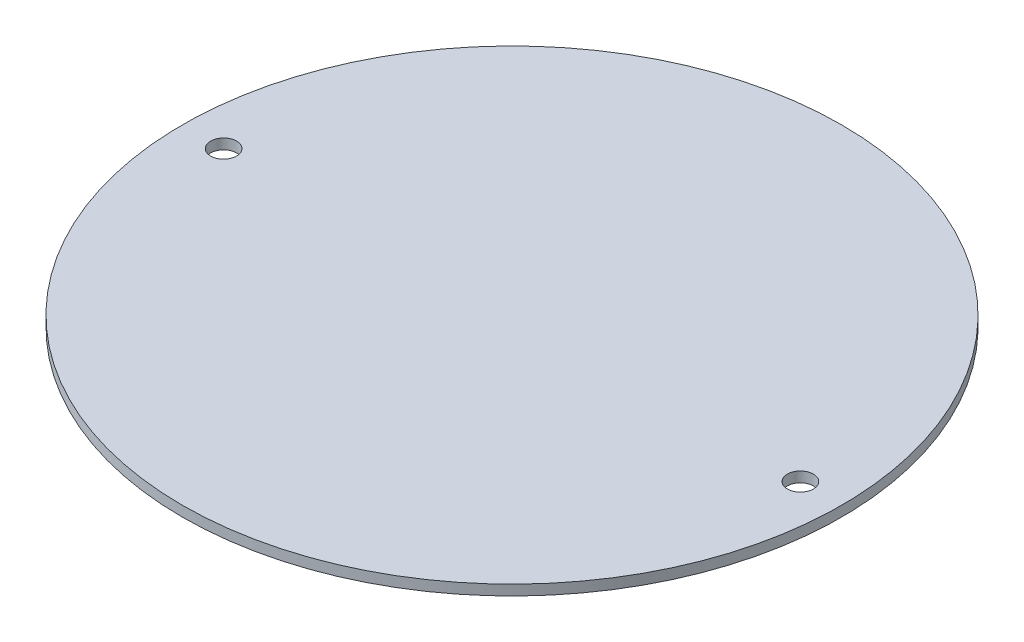
ISO-10303-21;
HEADER;
FILE_DESCRIPTION(('STEP AP214'),'2;1');
FILE_NAME('part.step','',(''),(''),'','','');
FILE_SCHEMA(('AUTOMOTIVE_DESIGN { 1 0 10303 214 1 1 1 1 }'));
ENDSEC;
DATA;
#1=APPLICATION_CONTEXT('core data for automotive mechanical design processes');
#2=APPLICATION_PROTOCOL_DEFINITION('international standard','automotive_design',2000,#1);
#3=PRODUCT_CONTEXT('',#1,'mechanical');
#4=PRODUCT('Part','Part','',(#3));
#5=PRODUCT_RELATED_PRODUCT_CATEGORY('part','',(#4));
#6=PRODUCT_DEFINITION_FORMATION('','',#4);
#7=PRODUCT_DEFINITION_CONTEXT('part definition',#1,'design');
#8=PRODUCT_DEFINITION('design','',#6,#7);
#9=PRODUCT_DEFINITION_SHAPE('','',#8);
#10=(LENGTH_UNIT() NAMED_UNIT(*) SI_UNIT(.MILLI.,.METRE.));
#11=(NAMED_UNIT(*) PLANE_ANGLE_UNIT() SI_UNIT($,.RADIAN.));
#12=(NAMED_UNIT(*) SI_UNIT($,.STERADIAN.) SOLID_ANGLE_UNIT());
#13=UNCERTAINTY_MEASURE_WITH_UNIT(LENGTH_MEASURE(1.E-05),#10,'distance_accuracy_value','');
#14=(GEOMETRIC_REPRESENTATION_CONTEXT(3) GLOBAL_UNCERTAINTY_ASSIGNED_CONTEXT((#13)) GLOBAL_UNIT_ASSIGNED_CONTEXT((#10,
#11,#12)) REPRESENTATION_CONTEXT('',''));
#15=CARTESIAN_POINT('',(0.,0.,0.));
#16=DIRECTION('',(0.,0.,1.));
#17=DIRECTION('',(1.,0.,0.));
#18=AXIS2_PLACEMENT_3D('',#15,#16,#17);
#19=CARTESIAN_POINT('',(0.,0.396875,0.));
#20=DIRECTION('',(0.,1.,0.));
#21=DIRECTION('',(0.,0.,1.));
#22=AXIS2_PLACEMENT_3D('',#19,#20,#21);
#23=PLANE('',#22);
#24=CARTESIAN_POINT('',(-22.225,0.396875,0.));
#25=DIRECTION('',(0.,1.,0.));
#26=DIRECTION('',(0.,0.,1.));
#27=AXIS2_PLACEMENT_3D('',#24,#25,#26);
#28=CIRCLE('',#27,1.);
#29=CARTESIAN_POINT('',(-22.225,0.396875,1.));
#30=VERTEX_POINT('',#29);
#31=EDGE_CURVE('E41',#30,#30,#28,.T.);
#32=ORIENTED_EDGE('',*,*,#31,.F.);
#33=EDGE_LOOP('',(#32));
#34=FACE_BOUND('',#33,.T.);
#35=CARTESIAN_POINT('',(0.,0.396875,0.));
#36=DIRECTION('',(0.,1.,0.));
#37=DIRECTION('',(0.,0.,1.));
#38=AXIS2_PLACEMENT_3D('',#35,#36,#37);
#39=CIRCLE('',#38,25.4);
#40=CARTESIAN_POINT('',(0.,0.396875,25.4));
#41=VERTEX_POINT('',#40);
#42=EDGE_CURVE('E10',#41,#41,#39,.T.);
#43=ORIENTED_EDGE('',*,*,#42,.T.);
#44=EDGE_LOOP('',(#43));
#45=FACE_BOUND('',#44,.T.);
#46=CARTESIAN_POINT('',(22.225,0.396875,0.));
#47=DIRECTION('',(0.,1.,0.));
#48=DIRECTION('',(0.,0.,1.));
#49=AXIS2_PLACEMENT_3D('',#46,#47,#48);
#50=CIRCLE('',#49,1.);
#51=CARTESIAN_POINT('',(22.225,0.396875,1.));
#52=VERTEX_POINT('',#51);
#53=EDGE_CURVE('E46',#52,#52,#50,.T.);
#54=ORIENTED_EDGE('',*,*,#53,.F.);
#55=EDGE_LOOP('',(#54));
#56=FACE_BOUND('',#55,.T.);
#57=ADVANCED_FACE('F30',(#34,#45,#56),#23,.T.);
#58=CARTESIAN_POINT('',(0.,-0.396875,0.));
#59=DIRECTION('',(0.,1.,0.));
#60=DIRECTION('',(0.,0.,1.));
#61=AXIS2_PLACEMENT_3D('',#58,#59,#60);
#62=PLANE('',#61);
#63=CARTESIAN_POINT('',(0.,-0.396875,0.));
#64=DIRECTION('',(0.,1.,0.));
#65=DIRECTION('',(0.,0.,1.));
#66=AXIS2_PLACEMENT_3D('',#63,#64,#65);
#67=CIRCLE('',#66,25.4);
#68=CARTESIAN_POINT('',(0.,-0.396875,25.4));
#69=VERTEX_POINT('',#68);
#70=EDGE_CURVE('E34',#69,#69,#67,.T.);
#71=ORIENTED_EDGE('',*,*,#70,.F.);
#72=EDGE_LOOP('',(#71));
#73=FACE_BOUND('',#72,.T.);
#74=CARTESIAN_POINT('',(-22.225,-0.396875,0.));
#75=DIRECTION('',(0.,1.,0.));
#76=DIRECTION('',(0.,0.,1.));
#77=AXIS2_PLACEMENT_3D('',#74,#75,#76);
#78=CIRCLE('',#77,1.);
#79=CARTESIAN_POINT('',(-22.225,-0.396875,1.));
#80=VERTEX_POINT('',#79);
#81=EDGE_CURVE('E43',#80,#80,#78,.T.);
#82=ORIENTED_EDGE('',*,*,#81,.T.);
#83=EDGE_LOOP('',(#82));
#84=FACE_BOUND('',#83,.T.);
#85=CARTESIAN_POINT('',(22.225,-0.396875,0.));
#86=DIRECTION('',(0.,1.,0.));
#87=DIRECTION('',(0.,0.,1.));
#88=AXIS2_PLACEMENT_3D('',#85,#86,#87);
#89=CIRCLE('',#88,1.);
#90=CARTESIAN_POINT('',(22.225,-0.396875,1.));
#91=VERTEX_POINT('',#90);
#92=EDGE_CURVE('E49',#91,#91,#89,.T.);
#93=ORIENTED_EDGE('',*,*,#92,.T.);
#94=EDGE_LOOP('',(#93));
#95=FACE_BOUND('',#94,.T.);
#96=ADVANCED_FACE('F59',(#73,#84,#95),#62,.F.);
#97=CARTESIAN_POINT('',(0.,0.396875,0.));
#98=DIRECTION('',(0.,-1.,0.));
#99=DIRECTION('',(0.,0.,-1.));
#100=AXIS2_PLACEMENT_3D('',#97,#98,#99);
#101=CYLINDRICAL_SURFACE('',#100,25.4);
#102=ORIENTED_EDGE('',*,*,#42,.F.);
#103=EDGE_LOOP('',(#102));
#104=FACE_BOUND('',#103,.T.);
#105=ORIENTED_EDGE('',*,*,#70,.T.);
#106=EDGE_LOOP('',(#105));
#107=FACE_BOUND('',#106,.T.);
#108=ADVANCED_FACE('F32',(#104,#107),#101,.T.);
#109=CARTESIAN_POINT('',(-22.225,0.396875,0.));
#110=DIRECTION('',(0.,-1.,0.));
#111=DIRECTION('',(0.,0.,-1.));
#112=AXIS2_PLACEMENT_3D('',#109,#110,#111);
#113=CYLINDRICAL_SURFACE('',#112,1.);
#114=ORIENTED_EDGE('',*,*,#31,.T.);
#115=EDGE_LOOP('',(#114));
#116=FACE_BOUND('',#115,.T.);
#117=ORIENTED_EDGE('',*,*,#81,.F.);
#118=EDGE_LOOP('',(#117));
#119=FACE_BOUND('',#118,.T.);
#120=ADVANCED_FACE('F68',(#116,#119),#113,.F.);
#121=CARTESIAN_POINT('',(22.225,0.396875,0.));
#122=DIRECTION('',(0.,-1.,0.));
#123=DIRECTION('',(0.,0.,-1.));
#124=AXIS2_PLACEMENT_3D('',#121,#122,#123);
#125=CYLINDRICAL_SURFACE('',#124,1.);
#126=ORIENTED_EDGE('',*,*,#53,.T.);
#127=EDGE_LOOP('',(#126));
#128=FACE_BOUND('',#127,.T.);
#129=ORIENTED_EDGE('',*,*,#92,.F.);
#130=EDGE_LOOP('',(#129));
#131=FACE_BOUND('',#130,.T.);
#132=ADVANCED_FACE('F55',(#128,#131),#125,.F.);
#133=CLOSED_SHELL('',(#57,#96,#108,#120,#132));
#134=MANIFOLD_SOLID_BREP('B2',#133);
#135=ADVANCED_BREP_SHAPE_REPRESENTATION('',(#18,#134),#14);
#136=SHAPE_DEFINITION_REPRESENTATION(#9,#135);
ENDSEC;
END-ISO-10303-21;
